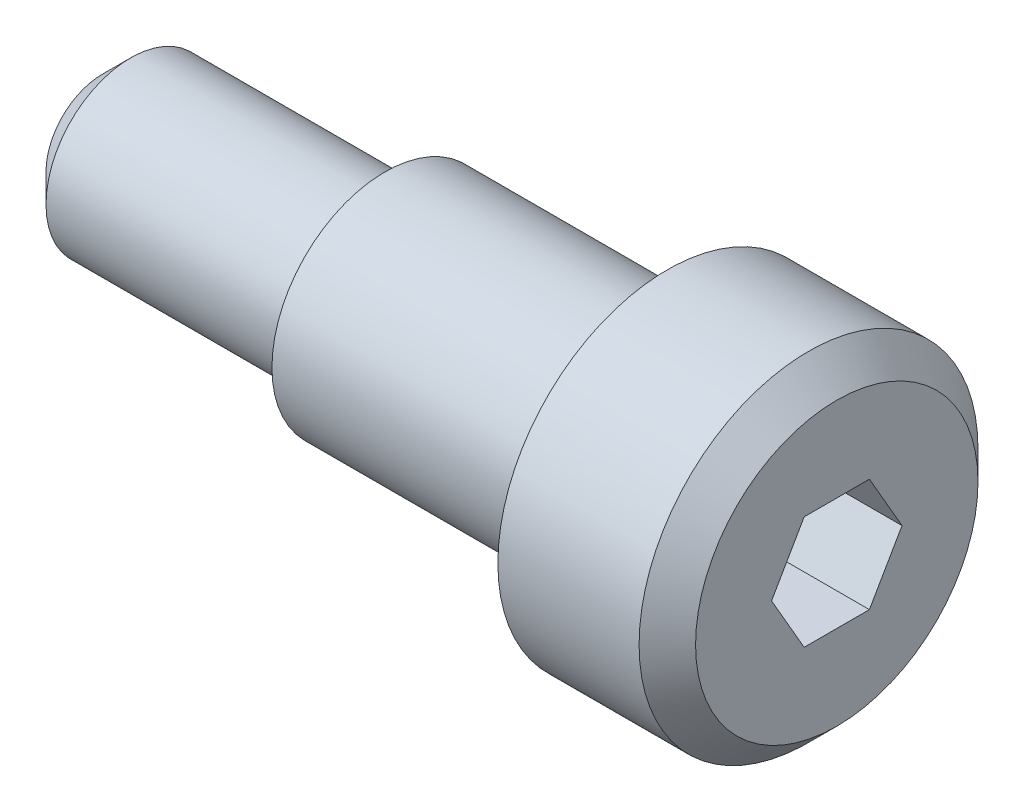
ISO-10303-21;
HEADER;
FILE_DESCRIPTION(('STEP AP214'),'2;1');
FILE_NAME('part.step','',(''),(''),'','','');
FILE_SCHEMA(('AUTOMOTIVE_DESIGN { 1 0 10303 214 1 1 1 1 }'));
ENDSEC;
DATA;
#1=APPLICATION_CONTEXT('core data for automotive mechanical design processes');
#2=APPLICATION_PROTOCOL_DEFINITION('international standard','automotive_design',2000,#1);
#3=PRODUCT_CONTEXT('',#1,'mechanical');
#4=PRODUCT('Part','Part','',(#3));
#5=PRODUCT_RELATED_PRODUCT_CATEGORY('part','',(#4));
#6=PRODUCT_DEFINITION_FORMATION('','',#4);
#7=PRODUCT_DEFINITION_CONTEXT('part definition',#1,'design');
#8=PRODUCT_DEFINITION('design','',#6,#7);
#9=PRODUCT_DEFINITION_SHAPE('','',#8);
#10=(LENGTH_UNIT() NAMED_UNIT(*) SI_UNIT(.MILLI.,.METRE.));
#11=(NAMED_UNIT(*) PLANE_ANGLE_UNIT() SI_UNIT($,.RADIAN.));
#12=(NAMED_UNIT(*) SI_UNIT($,.STERADIAN.) SOLID_ANGLE_UNIT());
#13=UNCERTAINTY_MEASURE_WITH_UNIT(LENGTH_MEASURE(1.E-05),#10,'distance_accuracy_value','');
#14=(GEOMETRIC_REPRESENTATION_CONTEXT(3) GLOBAL_UNCERTAINTY_ASSIGNED_CONTEXT((#13)) GLOBAL_UNIT_ASSIGNED_CONTEXT((#10,
#11,#12)) REPRESENTATION_CONTEXT('',''));
#15=CARTESIAN_POINT('',(0.,0.,0.));
#16=DIRECTION('',(0.,0.,1.));
#17=DIRECTION('',(1.,0.,0.));
#18=AXIS2_PLACEMENT_3D('',#15,#16,#17);
#19=CARTESIAN_POINT('',(0.,1.,0.));
#20=DIRECTION('',(1.,0.,0.));
#21=DIRECTION('',(0.,0.,-1.));
#22=AXIS2_PLACEMENT_3D('',#19,#20,#21);
#23=PLANE('',#22);
#24=CARTESIAN_POINT('',(0.,0.,0.));
#25=DIRECTION('',(-1.,0.,0.));
#26=DIRECTION('',(0.,0.,1.));
#27=AXIS2_PLACEMENT_3D('',#24,#25,#26);
#28=CIRCLE('',#27,1.);
#29=CARTESIAN_POINT('',(0.,0.,1.));
#30=VERTEX_POINT('',#29);
#31=EDGE_CURVE('E134',#30,#30,#28,.T.);
#32=ORIENTED_EDGE('',*,*,#31,.T.);
#33=EDGE_LOOP('',(#32));
#34=FACE_BOUND('',#33,.T.);
#35=ADVANCED_FACE('F33',(#34),#23,.F.);
#36=CARTESIAN_POINT('',(13.,0.,0.));
#37=DIRECTION('',(-1.,0.,0.));
#38=DIRECTION('',(0.,0.,1.));
#39=AXIS2_PLACEMENT_3D('',#36,#37,#38);
#40=PLANE('',#39);
#41=DIRECTION('',(0.,0.866025403784438,0.500000000000001));
#42=VECTOR('',#41,1.);
#43=CARTESIAN_POINT('',(13.,0.,-1.15470053837925));
#44=LINE('',#43,#42);
#45=CARTESIAN_POINT('',(13.,0.,-1.15470053837925));
#46=VERTEX_POINT('',#45);
#47=CARTESIAN_POINT('',(13.,1.,-0.577350269189625));
#48=VERTEX_POINT('',#47);
#49=EDGE_CURVE('E121',#46,#48,#44,.T.);
#50=ORIENTED_EDGE('',*,*,#49,.F.);
#51=DIRECTION('',(0.,0.866025403784439,-0.5));
#52=VECTOR('',#51,1.);
#53=CARTESIAN_POINT('',(13.,-1.,-0.577350269189628));
#54=LINE('',#53,#52);
#55=CARTESIAN_POINT('',(13.,-1.,-0.577350269189628));
#56=VERTEX_POINT('',#55);
#57=EDGE_CURVE('E47',#56,#46,#54,.T.);
#58=ORIENTED_EDGE('',*,*,#57,.F.);
#59=DIRECTION('',(0.,0.,-1.));
#60=VECTOR('',#59,1.);
#61=CARTESIAN_POINT('',(13.,-1.,0.577350269189626));
#62=LINE('',#61,#60);
#63=CARTESIAN_POINT('',(13.,-1.,0.577350269189626));
#64=VERTEX_POINT('',#63);
#65=EDGE_CURVE('E130',#64,#56,#62,.T.);
#66=ORIENTED_EDGE('',*,*,#65,.F.);
#67=DIRECTION('',(0.,-0.866025403784438,-0.5));
#68=VECTOR('',#67,1.);
#69=CARTESIAN_POINT('',(13.,0.,1.15470053837925));
#70=LINE('',#69,#68);
#71=CARTESIAN_POINT('',(13.,0.,1.15470053837925));
#72=VERTEX_POINT('',#71);
#73=EDGE_CURVE('E128',#72,#64,#70,.T.);
#74=ORIENTED_EDGE('',*,*,#73,.F.);
#75=DIRECTION('',(0.,-0.866025403784439,0.5));
#76=VECTOR('',#75,1.);
#77=CARTESIAN_POINT('',(13.,1.,0.577350269189626));
#78=LINE('',#77,#76);
#79=CARTESIAN_POINT('',(13.,1.,0.577350269189626));
#80=VERTEX_POINT('',#79);
#81=EDGE_CURVE('E95',#80,#72,#78,.T.);
#82=ORIENTED_EDGE('',*,*,#81,.F.);
#83=DIRECTION('',(0.,0.,1.));
#84=VECTOR('',#83,1.);
#85=CARTESIAN_POINT('',(13.,1.,-0.577350269189625));
#86=LINE('',#85,#84);
#87=EDGE_CURVE('E124',#48,#80,#86,.T.);
#88=ORIENTED_EDGE('',*,*,#87,.F.);
#89=EDGE_LOOP('',(#50,#58,#66,#74,#82,#88));
#90=FACE_BOUND('',#89,.T.);
#91=CARTESIAN_POINT('',(13.,0.,0.));
#92=DIRECTION('',(-1.,0.,0.));
#93=DIRECTION('',(0.,0.,1.));
#94=AXIS2_PLACEMENT_3D('',#91,#92,#93);
#95=CIRCLE('',#94,2.5);
#96=CARTESIAN_POINT('',(13.,0.,2.5));
#97=VERTEX_POINT('',#96);
#98=EDGE_CURVE('E11',#97,#97,#95,.T.);
#99=ORIENTED_EDGE('',*,*,#98,.F.);
#100=EDGE_LOOP('',(#99));
#101=FACE_BOUND('',#100,.T.);
#102=ADVANCED_FACE('F164',(#90,#101),#40,.F.);
#103=CARTESIAN_POINT('',(13.,0.,0.));
#104=DIRECTION('',(-1.,0.,0.));
#105=DIRECTION('',(0.,0.,1.));
#106=AXIS2_PLACEMENT_3D('',#103,#104,#105);
#107=CONICAL_SURFACE('',#106,2.5,0.785398163397448);
#108=CARTESIAN_POINT('',(12.5,0.,0.));
#109=DIRECTION('',(-1.,0.,0.));
#110=DIRECTION('',(0.,0.,1.));
#111=AXIS2_PLACEMENT_3D('',#108,#109,#110);
#112=CIRCLE('',#111,3.);
#113=CARTESIAN_POINT('',(12.5,0.,3.));
#114=VERTEX_POINT('',#113);
#115=EDGE_CURVE('E40',#114,#114,#112,.T.);
#116=ORIENTED_EDGE('',*,*,#115,.F.);
#117=EDGE_LOOP('',(#116));
#118=FACE_BOUND('',#117,.T.);
#119=ORIENTED_EDGE('',*,*,#98,.T.);
#120=EDGE_LOOP('',(#119));
#121=FACE_BOUND('',#120,.T.);
#122=ADVANCED_FACE('F161',(#118,#121),#107,.T.);
#123=CARTESIAN_POINT('',(0.,0.,0.));
#124=DIRECTION('',(-1.,0.,0.));
#125=DIRECTION('',(0.,0.,1.));
#126=AXIS2_PLACEMENT_3D('',#123,#124,#125);
#127=CYLINDRICAL_SURFACE('',#126,3.);
#128=CARTESIAN_POINT('',(10.,0.,0.));
#129=DIRECTION('',(-1.,0.,0.));
#130=DIRECTION('',(0.,0.,1.));
#131=AXIS2_PLACEMENT_3D('',#128,#129,#130);
#132=CIRCLE('',#131,3.);
#133=CARTESIAN_POINT('',(10.,0.,3.));
#134=VERTEX_POINT('',#133);
#135=EDGE_CURVE('E154',#134,#134,#132,.T.);
#136=ORIENTED_EDGE('',*,*,#135,.F.);
#137=EDGE_LOOP('',(#136));
#138=FACE_BOUND('',#137,.T.);
#139=ORIENTED_EDGE('',*,*,#115,.T.);
#140=EDGE_LOOP('',(#139));
#141=FACE_BOUND('',#140,.T.);
#142=ADVANCED_FACE('F159',(#138,#141),#127,.T.);
#143=CARTESIAN_POINT('',(10.,3.,0.));
#144=DIRECTION('',(1.,0.,0.));
#145=DIRECTION('',(0.,0.,-1.));
#146=AXIS2_PLACEMENT_3D('',#143,#144,#145);
#147=PLANE('',#146);
#148=CARTESIAN_POINT('',(10.,0.,0.));
#149=DIRECTION('',(-1.,0.,0.));
#150=DIRECTION('',(0.,0.,1.));
#151=AXIS2_PLACEMENT_3D('',#148,#149,#150);
#152=CIRCLE('',#151,2.);
#153=CARTESIAN_POINT('',(10.,0.,2.));
#154=VERTEX_POINT('',#153);
#155=EDGE_CURVE('E151',#154,#154,#152,.T.);
#156=ORIENTED_EDGE('',*,*,#155,.F.);
#157=EDGE_LOOP('',(#156));
#158=FACE_BOUND('',#157,.T.);
#159=ORIENTED_EDGE('',*,*,#135,.T.);
#160=EDGE_LOOP('',(#159));
#161=FACE_BOUND('',#160,.T.);
#162=ADVANCED_FACE('F178',(#158,#161),#147,.F.);
#163=CARTESIAN_POINT('',(0.,0.,0.));
#164=DIRECTION('',(-1.,0.,0.));
#165=DIRECTION('',(0.,0.,1.));
#166=AXIS2_PLACEMENT_3D('',#163,#164,#165);
#167=CYLINDRICAL_SURFACE('',#166,2.);
#168=CARTESIAN_POINT('',(5.,0.,0.));
#169=DIRECTION('',(-1.,0.,0.));
#170=DIRECTION('',(0.,0.,1.));
#171=AXIS2_PLACEMENT_3D('',#168,#169,#170);
#172=CIRCLE('',#171,2.);
#173=CARTESIAN_POINT('',(5.,0.,2.));
#174=VERTEX_POINT('',#173);
#175=EDGE_CURVE('E148',#174,#174,#172,.T.);
#176=ORIENTED_EDGE('',*,*,#175,.F.);
#177=EDGE_LOOP('',(#176));
#178=FACE_BOUND('',#177,.T.);
#179=ORIENTED_EDGE('',*,*,#155,.T.);
#180=EDGE_LOOP('',(#179));
#181=FACE_BOUND('',#180,.T.);
#182=ADVANCED_FACE('F182',(#178,#181),#167,.T.);
#183=CARTESIAN_POINT('',(5.,2.,0.));
#184=DIRECTION('',(1.,0.,0.));
#185=DIRECTION('',(0.,0.,-1.));
#186=AXIS2_PLACEMENT_3D('',#183,#184,#185);
#187=PLANE('',#186);
#188=CARTESIAN_POINT('',(5.,0.,0.));
#189=DIRECTION('',(-1.,0.,0.));
#190=DIRECTION('',(0.,0.,1.));
#191=AXIS2_PLACEMENT_3D('',#188,#189,#190);
#192=CIRCLE('',#191,1.5);
#193=CARTESIAN_POINT('',(5.,0.,1.5));
#194=VERTEX_POINT('',#193);
#195=EDGE_CURVE('E145',#194,#194,#192,.T.);
#196=ORIENTED_EDGE('',*,*,#195,.F.);
#197=EDGE_LOOP('',(#196));
#198=FACE_BOUND('',#197,.T.);
#199=ORIENTED_EDGE('',*,*,#175,.T.);
#200=EDGE_LOOP('',(#199));
#201=FACE_BOUND('',#200,.T.);
#202=ADVANCED_FACE('F186',(#198,#201),#187,.F.);
#203=CARTESIAN_POINT('',(0.,0.,0.));
#204=DIRECTION('',(-1.,0.,0.));
#205=DIRECTION('',(0.,0.,1.));
#206=AXIS2_PLACEMENT_3D('',#203,#204,#205);
#207=CYLINDRICAL_SURFACE('',#206,1.5);
#208=CARTESIAN_POINT('',(0.5,0.,0.));
#209=DIRECTION('',(-1.,0.,0.));
#210=DIRECTION('',(0.,0.,1.));
#211=AXIS2_PLACEMENT_3D('',#208,#209,#210);
#212=CIRCLE('',#211,1.5);
#213=CARTESIAN_POINT('',(0.5,0.,1.5));
#214=VERTEX_POINT('',#213);
#215=EDGE_CURVE('E142',#214,#214,#212,.T.);
#216=ORIENTED_EDGE('',*,*,#215,.F.);
#217=EDGE_LOOP('',(#216));
#218=FACE_BOUND('',#217,.T.);
#219=ORIENTED_EDGE('',*,*,#195,.T.);
#220=EDGE_LOOP('',(#219));
#221=FACE_BOUND('',#220,.T.);
#222=ADVANCED_FACE('F190',(#218,#221),#207,.T.);
#223=CARTESIAN_POINT('',(0.5,0.,0.));
#224=DIRECTION('',(1.,0.,0.));
#225=DIRECTION('',(0.,0.,-1.));
#226=AXIS2_PLACEMENT_3D('',#223,#224,#225);
#227=CONICAL_SURFACE('',#226,1.5,0.785398163397448);
#228=ORIENTED_EDGE('',*,*,#31,.F.);
#229=EDGE_LOOP('',(#228));
#230=FACE_BOUND('',#229,.T.);
#231=ORIENTED_EDGE('',*,*,#215,.T.);
#232=EDGE_LOOP('',(#231));
#233=FACE_BOUND('',#232,.T.);
#234=ADVANCED_FACE('F194',(#230,#233),#227,.T.);
#235=CARTESIAN_POINT('',(9.,-1.,-0.577350269189628));
#236=DIRECTION('',(0.,-0.5,-0.866025403784439));
#237=DIRECTION('',(0.,0.866025403784439,-0.5));
#238=AXIS2_PLACEMENT_3D('',#235,#236,#237);
#239=PLANE('',#238);
#240=ORIENTED_EDGE('',*,*,#57,.T.);
#241=DIRECTION('',(1.,0.,0.));
#242=VECTOR('',#241,1.);
#243=CARTESIAN_POINT('',(9.,0.,-1.15470053837925));
#244=LINE('',#243,#242);
#245=CARTESIAN_POINT('',(9.,0.,-1.15470053837925));
#246=VERTEX_POINT('',#245);
#247=EDGE_CURVE('E77',#246,#46,#244,.T.);
#248=ORIENTED_EDGE('',*,*,#247,.F.);
#249=DIRECTION('',(0.,0.866025403784439,-0.5));
#250=VECTOR('',#249,1.);
#251=CARTESIAN_POINT('',(9.,-1.,-0.577350269189628));
#252=LINE('',#251,#250);
#253=CARTESIAN_POINT('',(9.,-1.,-0.577350269189628));
#254=VERTEX_POINT('',#253);
#255=EDGE_CURVE('E132',#254,#246,#252,.T.);
#256=ORIENTED_EDGE('',*,*,#255,.F.);
#257=DIRECTION('',(1.,0.,0.));
#258=VECTOR('',#257,1.);
#259=CARTESIAN_POINT('',(9.,-1.,-0.577350269189628));
#260=LINE('',#259,#258);
#261=EDGE_CURVE('E55',#254,#56,#260,.T.);
#262=ORIENTED_EDGE('',*,*,#261,.T.);
#263=EDGE_LOOP('',(#240,#248,#256,#262));
#264=FACE_BOUND('',#263,.T.);
#265=ADVANCED_FACE('F198',(#264),#239,.F.);
#266=CARTESIAN_POINT('',(9.,-1.,0.577350269189626));
#267=DIRECTION('',(0.,-1.,0.));
#268=DIRECTION('',(0.,0.,-1.));
#269=AXIS2_PLACEMENT_3D('',#266,#267,#268);
#270=PLANE('',#269);
#271=ORIENTED_EDGE('',*,*,#65,.T.);
#272=ORIENTED_EDGE('',*,*,#261,.F.);
#273=DIRECTION('',(0.,0.,-1.));
#274=VECTOR('',#273,1.);
#275=CARTESIAN_POINT('',(9.,-1.,0.577350269189626));
#276=LINE('',#275,#274);
#277=CARTESIAN_POINT('',(9.,-1.,0.577350269189626));
#278=VERTEX_POINT('',#277);
#279=EDGE_CURVE('E107',#278,#254,#276,.T.);
#280=ORIENTED_EDGE('',*,*,#279,.F.);
#281=DIRECTION('',(1.,0.,0.));
#282=VECTOR('',#281,1.);
#283=CARTESIAN_POINT('',(9.,-1.,0.577350269189626));
#284=LINE('',#283,#282);
#285=EDGE_CURVE('E99',#278,#64,#284,.T.);
#286=ORIENTED_EDGE('',*,*,#285,.T.);
#287=EDGE_LOOP('',(#271,#272,#280,#286));
#288=FACE_BOUND('',#287,.T.);
#289=ADVANCED_FACE('F202',(#288),#270,.F.);
#290=CARTESIAN_POINT('',(9.,0.,1.15470053837925));
#291=DIRECTION('',(0.,-0.5,0.866025403784439));
#292=DIRECTION('',(0.,-0.866025403784438,-0.5));
#293=AXIS2_PLACEMENT_3D('',#290,#291,#292);
#294=PLANE('',#293);
#295=ORIENTED_EDGE('',*,*,#73,.T.);
#296=ORIENTED_EDGE('',*,*,#285,.F.);
#297=DIRECTION('',(0.,-0.866025403784438,-0.5));
#298=VECTOR('',#297,1.);
#299=CARTESIAN_POINT('',(9.,0.,1.15470053837925));
#300=LINE('',#299,#298);
#301=CARTESIAN_POINT('',(9.,0.,1.15470053837925));
#302=VERTEX_POINT('',#301);
#303=EDGE_CURVE('E103',#302,#278,#300,.T.);
#304=ORIENTED_EDGE('',*,*,#303,.F.);
#305=DIRECTION('',(1.,0.,0.));
#306=VECTOR('',#305,1.);
#307=CARTESIAN_POINT('',(9.,0.,1.15470053837925));
#308=LINE('',#307,#306);
#309=EDGE_CURVE('E88',#302,#72,#308,.T.);
#310=ORIENTED_EDGE('',*,*,#309,.T.);
#311=EDGE_LOOP('',(#295,#296,#304,#310));
#312=FACE_BOUND('',#311,.T.);
#313=ADVANCED_FACE('F104',(#312),#294,.F.);
#314=CARTESIAN_POINT('',(9.,1.,0.577350269189626));
#315=DIRECTION('',(0.,0.5,0.866025403784439));
#316=DIRECTION('',(0.,-0.866025403784439,0.5));
#317=AXIS2_PLACEMENT_3D('',#314,#315,#316);
#318=PLANE('',#317);
#319=ORIENTED_EDGE('',*,*,#81,.T.);
#320=ORIENTED_EDGE('',*,*,#309,.F.);
#321=DIRECTION('',(0.,-0.866025403784439,0.5));
#322=VECTOR('',#321,1.);
#323=CARTESIAN_POINT('',(9.,1.,0.577350269189626));
#324=LINE('',#323,#322);
#325=CARTESIAN_POINT('',(9.,1.,0.577350269189626));
#326=VERTEX_POINT('',#325);
#327=EDGE_CURVE('E92',#326,#302,#324,.T.);
#328=ORIENTED_EDGE('',*,*,#327,.F.);
#329=DIRECTION('',(1.,0.,0.));
#330=VECTOR('',#329,1.);
#331=CARTESIAN_POINT('',(9.,1.,0.577350269189626));
#332=LINE('',#331,#330);
#333=EDGE_CURVE('E100',#326,#80,#332,.T.);
#334=ORIENTED_EDGE('',*,*,#333,.T.);
#335=EDGE_LOOP('',(#319,#320,#328,#334));
#336=FACE_BOUND('',#335,.T.);
#337=ADVANCED_FACE('F90',(#336),#318,.F.);
#338=CARTESIAN_POINT('',(9.,1.,-0.577350269189625));
#339=DIRECTION('',(0.,1.,0.));
#340=DIRECTION('',(0.,0.,1.));
#341=AXIS2_PLACEMENT_3D('',#338,#339,#340);
#342=PLANE('',#341);
#343=ORIENTED_EDGE('',*,*,#87,.T.);
#344=ORIENTED_EDGE('',*,*,#333,.F.);
#345=DIRECTION('',(0.,0.,1.));
#346=VECTOR('',#345,1.);
#347=CARTESIAN_POINT('',(9.,1.,-0.577350269189625));
#348=LINE('',#347,#346);
#349=CARTESIAN_POINT('',(9.,1.,-0.577350269189625));
#350=VERTEX_POINT('',#349);
#351=EDGE_CURVE('E113',#350,#326,#348,.T.);
#352=ORIENTED_EDGE('',*,*,#351,.F.);
#353=DIRECTION('',(1.,0.,0.));
#354=VECTOR('',#353,1.);
#355=CARTESIAN_POINT('',(9.,1.,-0.577350269189625));
#356=LINE('',#355,#354);
#357=EDGE_CURVE('E137',#350,#48,#356,.T.);
#358=ORIENTED_EDGE('',*,*,#357,.T.);
#359=EDGE_LOOP('',(#343,#344,#352,#358));
#360=FACE_BOUND('',#359,.T.);
#361=ADVANCED_FACE('F206',(#360),#342,.F.);
#362=CARTESIAN_POINT('',(9.,0.,-1.15470053837925));
#363=DIRECTION('',(0.,0.500000000000001,-0.866025403784438));
#364=DIRECTION('',(0.,0.866025403784438,0.500000000000001));
#365=AXIS2_PLACEMENT_3D('',#362,#363,#364);
#366=PLANE('',#365);
#367=ORIENTED_EDGE('',*,*,#49,.T.);
#368=ORIENTED_EDGE('',*,*,#357,.F.);
#369=DIRECTION('',(0.,0.866025403784438,0.500000000000001));
#370=VECTOR('',#369,1.);
#371=CARTESIAN_POINT('',(9.,0.,-1.15470053837925));
#372=LINE('',#371,#370);
#373=EDGE_CURVE('E115',#246,#350,#372,.T.);
#374=ORIENTED_EDGE('',*,*,#373,.F.);
#375=ORIENTED_EDGE('',*,*,#247,.T.);
#376=EDGE_LOOP('',(#367,#368,#374,#375));
#377=FACE_BOUND('',#376,.T.);
#378=ADVANCED_FACE('F203',(#377),#366,.F.);
#379=CARTESIAN_POINT('',(9.,0.,0.));
#380=DIRECTION('',(1.,0.,0.));
#381=DIRECTION('',(0.,0.,-1.));
#382=AXIS2_PLACEMENT_3D('',#379,#380,#381);
#383=PLANE('',#382);
#384=ORIENTED_EDGE('',*,*,#255,.T.);
#385=ORIENTED_EDGE('',*,*,#373,.T.);
#386=ORIENTED_EDGE('',*,*,#351,.T.);
#387=ORIENTED_EDGE('',*,*,#327,.T.);
#388=ORIENTED_EDGE('',*,*,#303,.T.);
#389=ORIENTED_EDGE('',*,*,#279,.T.);
#390=EDGE_LOOP('',(#384,#385,#386,#387,#388,#389));
#391=FACE_BOUND('',#390,.T.);
#392=ADVANCED_FACE('F110',(#391),#383,.T.);
#393=CLOSED_SHELL('',(#35,#102,#122,#142,#162,#182,#202,#222,#234,#265,#289,#313,#337,#361,#378,#392));
#394=MANIFOLD_SOLID_BREP('B2',#393);
#395=ADVANCED_BREP_SHAPE_REPRESENTATION('',(#18,#394),#14);
#396=SHAPE_DEFINITION_REPRESENTATION(#9,#395);
ENDSEC;
END-ISO-10303-21;
